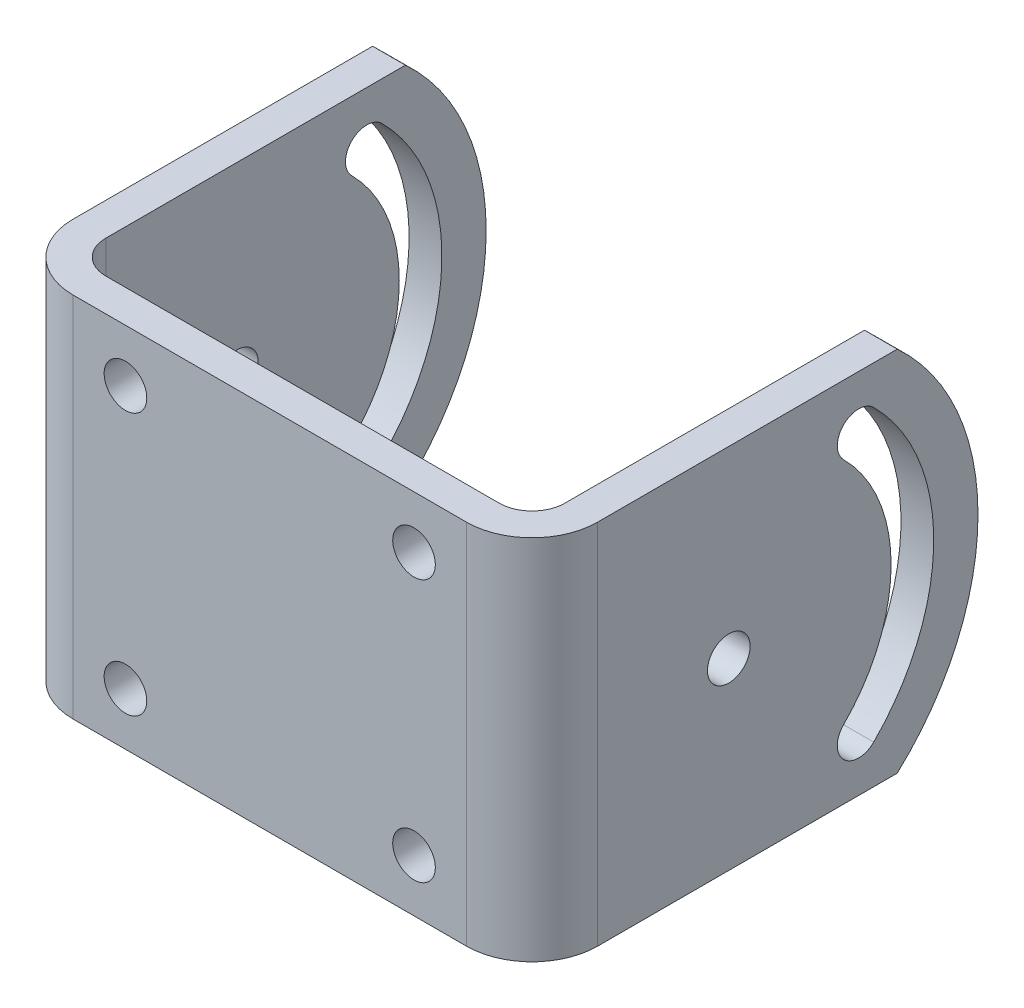
ISO-10303-21;
HEADER;
FILE_DESCRIPTION(('STEP AP214'),'2;1');
FILE_NAME('part.step','',(''),(''),'','','');
FILE_SCHEMA(('AUTOMOTIVE_DESIGN { 1 0 10303 214 1 1 1 1 }'));
ENDSEC;
DATA;
#1=APPLICATION_CONTEXT('core data for automotive mechanical design processes');
#2=APPLICATION_PROTOCOL_DEFINITION('international standard','automotive_design',2000,#1);
#3=PRODUCT_CONTEXT('',#1,'mechanical');
#4=PRODUCT('Part','Part','',(#3));
#5=PRODUCT_RELATED_PRODUCT_CATEGORY('part','',(#4));
#6=PRODUCT_DEFINITION_FORMATION('','',#4);
#7=PRODUCT_DEFINITION_CONTEXT('part definition',#1,'design');
#8=PRODUCT_DEFINITION('design','',#6,#7);
#9=PRODUCT_DEFINITION_SHAPE('','',#8);
#10=(LENGTH_UNIT() NAMED_UNIT(*) SI_UNIT(.MILLI.,.METRE.));
#11=(NAMED_UNIT(*) PLANE_ANGLE_UNIT() SI_UNIT($,.RADIAN.));
#12=(NAMED_UNIT(*) SI_UNIT($,.STERADIAN.) SOLID_ANGLE_UNIT());
#13=UNCERTAINTY_MEASURE_WITH_UNIT(LENGTH_MEASURE(1.E-05),#10,'distance_accuracy_value','');
#14=(GEOMETRIC_REPRESENTATION_CONTEXT(3) GLOBAL_UNCERTAINTY_ASSIGNED_CONTEXT((#13)) GLOBAL_UNIT_ASSIGNED_CONTEXT((#10,
#11,#12)) REPRESENTATION_CONTEXT('',''));
#15=CARTESIAN_POINT('',(0.,0.,0.));
#16=DIRECTION('',(0.,0.,1.));
#17=DIRECTION('',(1.,0.,0.));
#18=AXIS2_PLACEMENT_3D('',#15,#16,#17);
#19=CARTESIAN_POINT('',(-39.9999997680761,13.1115896804524,86.7010103081436));
#20=DIRECTION('',(-1.,0.,0.));
#21=DIRECTION('',(0.,0.,1.));
#22=AXIS2_PLACEMENT_3D('',#19,#20,#21);
#23=CYLINDRICAL_SURFACE('',#22,3.25);
#24=DIRECTION('',(-1.,0.,0.));
#25=VECTOR('',#24,1.);
#26=CARTESIAN_POINT('',(-39.9999997680761,10.8134926415961,88.9991073469999));
#27=LINE('',#26,#25);
#28=CARTESIAN_POINT('',(35.0000002319239,10.8134926415961,88.9991073469999));
#29=VERTEX_POINT('',#28);
#30=CARTESIAN_POINT('',(40.0000002319239,10.8134926415961,88.9991073469999));
#31=VERTEX_POINT('',#30);
#32=EDGE_CURVE('E151',#29,#31,#27,.F.);
#33=ORIENTED_EDGE('',*,*,#32,.F.);
#34=CARTESIAN_POINT('',(35.0000002319239,13.1115896804524,86.7010103081436));
#35=DIRECTION('',(-1.,0.,0.));
#36=DIRECTION('',(0.,0.,1.));
#37=AXIS2_PLACEMENT_3D('',#34,#35,#36);
#38=CIRCLE('',#37,3.25);
#39=CARTESIAN_POINT('',(35.0000002319239,15.4096867193086,84.4029132692874));
#40=VERTEX_POINT('',#39);
#41=EDGE_CURVE('E292',#40,#29,#38,.F.);
#42=ORIENTED_EDGE('',*,*,#41,.F.);
#43=DIRECTION('',(-1.,0.,0.));
#44=VECTOR('',#43,1.);
#45=CARTESIAN_POINT('',(-39.9999997680761,15.4096867193086,84.4029132692873));
#46=LINE('',#45,#44);
#47=CARTESIAN_POINT('',(40.0000002319239,15.4096867193086,84.4029132692873));
#48=VERTEX_POINT('',#47);
#49=EDGE_CURVE('E193',#40,#48,#46,.F.);
#50=ORIENTED_EDGE('',*,*,#49,.T.);
#51=CARTESIAN_POINT('',(40.0000002319239,13.1115896804524,86.7010103081436));
#52=DIRECTION('',(-1.,0.,0.));
#53=DIRECTION('',(0.,0.,1.));
#54=AXIS2_PLACEMENT_3D('',#51,#52,#53);
#55=CIRCLE('',#54,3.25);
#56=EDGE_CURVE('E299',#48,#31,#55,.F.);
#57=ORIENTED_EDGE('',*,*,#56,.T.);
#58=EDGE_LOOP('',(#33,#42,#50,#57));
#59=FACE_BOUND('',#58,.T.);
#60=ADVANCED_FACE('F17',(#59),#23,.F.);
#61=CARTESIAN_POINT('',(-39.9999997680761,-6.68740019277098,106.500000181367));
#62=DIRECTION('',(-1.,0.,0.));
#63=DIRECTION('',(0.,0.,1.));
#64=AXIS2_PLACEMENT_3D('',#61,#62,#63);
#65=CYLINDRICAL_SURFACE('',#64,24.75);
#66=CARTESIAN_POINT('',(35.0000002319239,-6.68740019277098,106.500000181367));
#67=DIRECTION('',(-1.,0.,0.));
#68=DIRECTION('',(0.,0.,1.));
#69=AXIS2_PLACEMENT_3D('',#66,#67,#68);
#70=CIRCLE('',#69,24.75);
#71=CARTESIAN_POINT('',(35.0000002319239,-24.188293027138,88.9991073469999));
#72=VERTEX_POINT('',#71);
#73=EDGE_CURVE('E290',#29,#72,#70,.T.);
#74=ORIENTED_EDGE('',*,*,#73,.F.);
#75=ORIENTED_EDGE('',*,*,#32,.T.);
#76=CARTESIAN_POINT('',(40.0000002319239,-6.68740019277098,106.500000181367));
#77=DIRECTION('',(-1.,0.,0.));
#78=DIRECTION('',(0.,0.,1.));
#79=AXIS2_PLACEMENT_3D('',#76,#77,#78);
#80=CIRCLE('',#79,24.75);
#81=CARTESIAN_POINT('',(40.0000002319239,-24.188293027138,88.9991073469999));
#82=VERTEX_POINT('',#81);
#83=EDGE_CURVE('E20',#31,#82,#80,.T.);
#84=ORIENTED_EDGE('',*,*,#83,.T.);
#85=DIRECTION('',(-1.,0.,0.));
#86=VECTOR('',#85,1.);
#87=CARTESIAN_POINT('',(-39.9999997680761,-24.188293027138,88.9991073469999));
#88=LINE('',#87,#86);
#89=EDGE_CURVE('E158',#82,#72,#88,.T.);
#90=ORIENTED_EDGE('',*,*,#89,.T.);
#91=EDGE_LOOP('',(#74,#75,#84,#90));
#92=FACE_BOUND('',#91,.T.);
#93=ADVANCED_FACE('F173',(#92),#65,.T.);
#94=CARTESIAN_POINT('',(-39.9999997680761,-26.4863900659943,86.7010103081436));
#95=DIRECTION('',(-1.,0.,0.));
#96=DIRECTION('',(0.,0.,1.));
#97=AXIS2_PLACEMENT_3D('',#94,#95,#96);
#98=CYLINDRICAL_SURFACE('',#97,3.25);
#99=DIRECTION('',(-1.,0.,0.));
#100=VECTOR('',#99,1.);
#101=CARTESIAN_POINT('',(-39.9999997680761,-28.7844871048505,84.4029132692874));
#102=LINE('',#101,#100);
#103=CARTESIAN_POINT('',(40.0000002319239,-28.7844871048505,84.4029132692873));
#104=VERTEX_POINT('',#103);
#105=CARTESIAN_POINT('',(35.0000002319239,-28.7844871048506,84.4029132692873));
#106=VERTEX_POINT('',#105);
#107=EDGE_CURVE('E164',#104,#106,#102,.T.);
#108=ORIENTED_EDGE('',*,*,#107,.T.);
#109=CARTESIAN_POINT('',(35.0000002319239,-26.4863900659943,86.7010103081436));
#110=DIRECTION('',(-1.,0.,0.));
#111=DIRECTION('',(0.,0.,1.));
#112=AXIS2_PLACEMENT_3D('',#109,#110,#111);
#113=CIRCLE('',#112,3.25);
#114=EDGE_CURVE('E163',#72,#106,#113,.F.);
#115=ORIENTED_EDGE('',*,*,#114,.F.);
#116=ORIENTED_EDGE('',*,*,#89,.F.);
#117=CARTESIAN_POINT('',(40.0000002319239,-26.4863900659943,86.7010103081436));
#118=DIRECTION('',(-1.,0.,0.));
#119=DIRECTION('',(0.,0.,1.));
#120=AXIS2_PLACEMENT_3D('',#117,#118,#119);
#121=CIRCLE('',#120,3.25);
#122=EDGE_CURVE('E162',#82,#104,#121,.F.);
#123=ORIENTED_EDGE('',*,*,#122,.T.);
#124=EDGE_LOOP('',(#108,#115,#116,#123));
#125=FACE_BOUND('',#124,.T.);
#126=ADVANCED_FACE('F161',(#125),#98,.F.);
#127=CARTESIAN_POINT('',(-39.9999997680761,-6.68740019277098,106.500000181367));
#128=DIRECTION('',(-1.,0.,0.));
#129=DIRECTION('',(0.,0.,1.));
#130=AXIS2_PLACEMENT_3D('',#127,#128,#129);
#131=CYLINDRICAL_SURFACE('',#130,31.25);
#132=ORIENTED_EDGE('',*,*,#49,.F.);
#133=CARTESIAN_POINT('',(35.0000002319239,-6.68740019277098,106.500000181367));
#134=DIRECTION('',(-1.,0.,0.));
#135=DIRECTION('',(0.,0.,1.));
#136=AXIS2_PLACEMENT_3D('',#133,#134,#135);
#137=CIRCLE('',#136,31.25);
#138=EDGE_CURVE('E286',#106,#40,#137,.F.);
#139=ORIENTED_EDGE('',*,*,#138,.F.);
#140=ORIENTED_EDGE('',*,*,#107,.F.);
#141=CARTESIAN_POINT('',(40.0000002319239,-6.68740019277098,106.500000181367));
#142=DIRECTION('',(-1.,0.,0.));
#143=DIRECTION('',(0.,0.,1.));
#144=AXIS2_PLACEMENT_3D('',#141,#142,#143);
#145=CIRCLE('',#144,31.25);
#146=EDGE_CURVE('E172',#104,#48,#145,.F.);
#147=ORIENTED_EDGE('',*,*,#146,.T.);
#148=EDGE_LOOP('',(#132,#139,#140,#147));
#149=FACE_BOUND('',#148,.T.);
#150=ADVANCED_FACE('F302',(#149),#131,.F.);
#151=CARTESIAN_POINT('',(-39.9999997680761,-6.68740019277098,106.500000181367));
#152=DIRECTION('',(-1.,0.,0.));
#153=DIRECTION('',(0.,0.,1.));
#154=AXIS2_PLACEMENT_3D('',#151,#152,#153);
#155=CYLINDRICAL_SURFACE('',#154,3.25);
#156=CARTESIAN_POINT('',(35.0000002319239,-6.68740019277098,106.500000181367));
#157=DIRECTION('',(-1.,0.,0.));
#158=DIRECTION('',(0.,0.,1.));
#159=AXIS2_PLACEMENT_3D('',#156,#157,#158);
#160=CIRCLE('',#159,3.25);
#161=CARTESIAN_POINT('',(35.0000002319239,-6.68740019277098,109.750000181367));
#162=VERTEX_POINT('',#161);
#163=EDGE_CURVE('E283',#162,#162,#160,.F.);
#164=ORIENTED_EDGE('',*,*,#163,.F.);
#165=EDGE_LOOP('',(#164));
#166=FACE_BOUND('',#165,.T.);
#167=CARTESIAN_POINT('',(40.0000002319239,-6.68740019277098,106.500000181367));
#168=DIRECTION('',(-1.,0.,0.));
#169=DIRECTION('',(0.,0.,1.));
#170=AXIS2_PLACEMENT_3D('',#167,#168,#169);
#171=CIRCLE('',#170,3.25);
#172=CARTESIAN_POINT('',(40.0000002319239,-6.68740019277098,109.750000181367));
#173=VERTEX_POINT('',#172);
#174=EDGE_CURVE('E296',#173,#173,#171,.F.);
#175=ORIENTED_EDGE('',*,*,#174,.T.);
#176=EDGE_LOOP('',(#175));
#177=FACE_BOUND('',#176,.T.);
#178=ADVANCED_FACE('F406',(#166,#177),#155,.F.);
#179=CARTESIAN_POINT('',(-39.9999997680761,-6.68740019277098,106.500000181367));
#180=DIRECTION('',(-1.,0.,0.));
#181=DIRECTION('',(0.,0.,1.));
#182=AXIS2_PLACEMENT_3D('',#179,#180,#181);
#183=CYLINDRICAL_SURFACE('',#182,24.75);
#184=CARTESIAN_POINT('',(-39.9999997680761,-6.68740019277098,106.500000181367));
#185=DIRECTION('',(-1.,0.,0.));
#186=DIRECTION('',(0.,0.,1.));
#187=AXIS2_PLACEMENT_3D('',#184,#185,#186);
#188=CIRCLE('',#187,24.75);
#189=CARTESIAN_POINT('',(-39.9999997680761,10.8134926415961,88.9991073469999));
#190=VERTEX_POINT('',#189);
#191=CARTESIAN_POINT('',(-39.9999997680761,-24.188293027138,88.9991073469999));
#192=VERTEX_POINT('',#191);
#193=EDGE_CURVE('E271',#190,#192,#188,.T.);
#194=ORIENTED_EDGE('',*,*,#193,.F.);
#195=DIRECTION('',(-1.,0.,0.));
#196=VECTOR('',#195,1.);
#197=CARTESIAN_POINT('',(-39.9999997680761,10.8134926415961,88.9991073469999));
#198=LINE('',#197,#196);
#199=CARTESIAN_POINT('',(-34.9999997680761,10.8134926415961,88.9991073469999));
#200=VERTEX_POINT('',#199);
#201=EDGE_CURVE('E174',#190,#200,#198,.F.);
#202=ORIENTED_EDGE('',*,*,#201,.T.);
#203=CARTESIAN_POINT('',(-34.9999997680761,-6.68740019277098,106.500000181367));
#204=DIRECTION('',(-1.,0.,0.));
#205=DIRECTION('',(0.,0.,1.));
#206=AXIS2_PLACEMENT_3D('',#203,#204,#205);
#207=CIRCLE('',#206,24.75);
#208=CARTESIAN_POINT('',(-34.9999997680761,-24.188293027138,88.9991073469999));
#209=VERTEX_POINT('',#208);
#210=EDGE_CURVE('E262',#200,#209,#207,.T.);
#211=ORIENTED_EDGE('',*,*,#210,.T.);
#212=DIRECTION('',(-1.,0.,0.));
#213=VECTOR('',#212,1.);
#214=CARTESIAN_POINT('',(-39.9999997680761,-24.188293027138,88.9991073469999));
#215=LINE('',#214,#213);
#216=EDGE_CURVE('E190',#209,#192,#215,.T.);
#217=ORIENTED_EDGE('',*,*,#216,.T.);
#218=EDGE_LOOP('',(#194,#202,#211,#217));
#219=FACE_BOUND('',#218,.T.);
#220=ADVANCED_FACE('F402',(#219),#183,.T.);
#221=CARTESIAN_POINT('',(-39.9999997680761,-26.4863900659943,86.7010103081436));
#222=DIRECTION('',(-1.,0.,0.));
#223=DIRECTION('',(0.,0.,1.));
#224=AXIS2_PLACEMENT_3D('',#221,#222,#223);
#225=CYLINDRICAL_SURFACE('',#224,3.25);
#226=DIRECTION('',(-1.,0.,0.));
#227=VECTOR('',#226,1.);
#228=CARTESIAN_POINT('',(-39.9999997680761,-28.7844871048505,84.4029132692874));
#229=LINE('',#228,#227);
#230=CARTESIAN_POINT('',(-34.9999997680761,-28.7844871048505,84.4029132692873));
#231=VERTEX_POINT('',#230);
#232=CARTESIAN_POINT('',(-39.9999997680761,-28.7844871048506,84.4029132692873));
#233=VERTEX_POINT('',#232);
#234=EDGE_CURVE('E183',#231,#233,#229,.T.);
#235=ORIENTED_EDGE('',*,*,#234,.T.);
#236=CARTESIAN_POINT('',(-39.9999997680761,-26.4863900659943,86.7010103081436));
#237=DIRECTION('',(-1.,0.,0.));
#238=DIRECTION('',(0.,0.,1.));
#239=AXIS2_PLACEMENT_3D('',#236,#237,#238);
#240=CIRCLE('',#239,3.25);
#241=EDGE_CURVE('E268',#192,#233,#240,.F.);
#242=ORIENTED_EDGE('',*,*,#241,.F.);
#243=ORIENTED_EDGE('',*,*,#216,.F.);
#244=CARTESIAN_POINT('',(-34.9999997680761,-26.4863900659943,86.7010103081436));
#245=DIRECTION('',(-1.,0.,0.));
#246=DIRECTION('',(0.,0.,1.));
#247=AXIS2_PLACEMENT_3D('',#244,#245,#246);
#248=CIRCLE('',#247,3.25);
#249=EDGE_CURVE('E259',#209,#231,#248,.F.);
#250=ORIENTED_EDGE('',*,*,#249,.T.);
#251=EDGE_LOOP('',(#235,#242,#243,#250));
#252=FACE_BOUND('',#251,.T.);
#253=ADVANCED_FACE('F398',(#252),#225,.F.);
#254=CARTESIAN_POINT('',(-39.9999997680761,-6.68740019277098,106.500000181367));
#255=DIRECTION('',(-1.,0.,0.));
#256=DIRECTION('',(0.,0.,1.));
#257=AXIS2_PLACEMENT_3D('',#254,#255,#256);
#258=CYLINDRICAL_SURFACE('',#257,31.25);
#259=DIRECTION('',(-1.,0.,0.));
#260=VECTOR('',#259,1.);
#261=CARTESIAN_POINT('',(-39.9999997680761,15.4096867193086,84.4029132692873));
#262=LINE('',#261,#260);
#263=CARTESIAN_POINT('',(-34.9999997680761,15.4096867193087,84.4029132692873));
#264=VERTEX_POINT('',#263);
#265=CARTESIAN_POINT('',(-39.9999997680761,15.4096867193086,84.4029132692873));
#266=VERTEX_POINT('',#265);
#267=EDGE_CURVE('E176',#264,#266,#262,.T.);
#268=ORIENTED_EDGE('',*,*,#267,.T.);
#269=CARTESIAN_POINT('',(-39.9999997680761,-6.68740019277098,106.500000181367));
#270=DIRECTION('',(-1.,0.,0.));
#271=DIRECTION('',(0.,0.,1.));
#272=AXIS2_PLACEMENT_3D('',#269,#270,#271);
#273=CIRCLE('',#272,31.25);
#274=EDGE_CURVE('E276',#233,#266,#273,.F.);
#275=ORIENTED_EDGE('',*,*,#274,.F.);
#276=ORIENTED_EDGE('',*,*,#234,.F.);
#277=CARTESIAN_POINT('',(-34.9999997680761,-6.68740019277098,106.500000181367));
#278=DIRECTION('',(-1.,0.,0.));
#279=DIRECTION('',(0.,0.,1.));
#280=AXIS2_PLACEMENT_3D('',#277,#278,#279);
#281=CIRCLE('',#280,31.25);
#282=EDGE_CURVE('E256',#231,#264,#281,.F.);
#283=ORIENTED_EDGE('',*,*,#282,.T.);
#284=EDGE_LOOP('',(#268,#275,#276,#283));
#285=FACE_BOUND('',#284,.T.);
#286=ADVANCED_FACE('F394',(#285),#258,.F.);
#287=CARTESIAN_POINT('',(-39.9999997680761,13.1115896804524,86.7010103081436));
#288=DIRECTION('',(-1.,0.,0.));
#289=DIRECTION('',(0.,0.,1.));
#290=AXIS2_PLACEMENT_3D('',#287,#288,#289);
#291=CYLINDRICAL_SURFACE('',#290,3.25);
#292=ORIENTED_EDGE('',*,*,#201,.F.);
#293=CARTESIAN_POINT('',(-39.9999997680761,13.1115896804524,86.7010103081436));
#294=DIRECTION('',(-1.,0.,0.));
#295=DIRECTION('',(0.,0.,1.));
#296=AXIS2_PLACEMENT_3D('',#293,#294,#295);
#297=CIRCLE('',#296,3.25);
#298=EDGE_CURVE('E273',#266,#190,#297,.F.);
#299=ORIENTED_EDGE('',*,*,#298,.F.);
#300=ORIENTED_EDGE('',*,*,#267,.F.);
#301=CARTESIAN_POINT('',(-34.9999997680761,13.1115896804524,86.7010103081436));
#302=DIRECTION('',(-1.,0.,0.));
#303=DIRECTION('',(0.,0.,1.));
#304=AXIS2_PLACEMENT_3D('',#301,#302,#303);
#305=CIRCLE('',#304,3.25);
#306=EDGE_CURVE('E254',#264,#200,#305,.F.);
#307=ORIENTED_EDGE('',*,*,#306,.T.);
#308=EDGE_LOOP('',(#292,#299,#300,#307));
#309=FACE_BOUND('',#308,.T.);
#310=ADVANCED_FACE('F390',(#309),#291,.F.);
#311=CARTESIAN_POINT('',(-39.9999997680761,-6.68740019277098,106.500000181367));
#312=DIRECTION('',(-1.,0.,0.));
#313=DIRECTION('',(0.,0.,1.));
#314=AXIS2_PLACEMENT_3D('',#311,#312,#313);
#315=CYLINDRICAL_SURFACE('',#314,3.25);
#316=CARTESIAN_POINT('',(-34.9999997680761,-6.68740019277098,106.500000181367));
#317=DIRECTION('',(-1.,0.,0.));
#318=DIRECTION('',(0.,0.,1.));
#319=AXIS2_PLACEMENT_3D('',#316,#317,#318);
#320=CIRCLE('',#319,3.25);
#321=CARTESIAN_POINT('',(-34.9999997680761,-6.68740019277098,109.750000181367));
#322=VERTEX_POINT('',#321);
#323=EDGE_CURVE('E251',#322,#322,#320,.F.);
#324=ORIENTED_EDGE('',*,*,#323,.T.);
#325=EDGE_LOOP('',(#324));
#326=FACE_BOUND('',#325,.T.);
#327=CARTESIAN_POINT('',(-39.9999997680761,-6.68740019277098,106.500000181367));
#328=DIRECTION('',(-1.,0.,0.));
#329=DIRECTION('',(0.,0.,1.));
#330=AXIS2_PLACEMENT_3D('',#327,#328,#329);
#331=CIRCLE('',#330,3.25);
#332=CARTESIAN_POINT('',(-39.9999997680761,-6.68740019277098,109.750000181367));
#333=VERTEX_POINT('',#332);
#334=EDGE_CURVE('E278',#333,#333,#331,.F.);
#335=ORIENTED_EDGE('',*,*,#334,.F.);
#336=EDGE_LOOP('',(#335));
#337=FACE_BOUND('',#336,.T.);
#338=ADVANCED_FACE('F386',(#326,#337),#315,.F.);
#339=CARTESIAN_POINT('',(40.0000002319239,-4.03756275760834,80.8215675263217));
#340=DIRECTION('',(-1.,0.,0.));
#341=DIRECTION('',(0.,0.,1.));
#342=AXIS2_PLACEMENT_3D('',#339,#340,#341);
#343=PLANE('',#342);
#344=DIRECTION('',(0.,0.,1.));
#345=VECTOR('',#344,1.);
#346=CARTESIAN_POINT('',(40.0000002319239,-34.6874001927711,126.500000181368));
#347=LINE('',#346,#345);
#348=CARTESIAN_POINT('',(40.0000002319239,-34.6874001927711,126.500000181368));
#349=VERTEX_POINT('',#348);
#350=CARTESIAN_POINT('',(40.0000002319239,-34.6874001927722,80.809535024038));
#351=VERTEX_POINT('',#350);
#352=EDGE_CURVE('E246',#349,#351,#347,.F.);
#353=ORIENTED_EDGE('',*,*,#352,.T.);
#354=CARTESIAN_POINT('',(40.0000002319239,-6.68740019277098,106.500000181367));
#355=DIRECTION('',(-1.,0.,0.));
#356=DIRECTION('',(0.,0.,1.));
#357=AXIS2_PLACEMENT_3D('',#354,#355,#356);
#358=CIRCLE('',#357,38.);
#359=CARTESIAN_POINT('',(40.0000002319239,21.3125998072287,80.8095350240363));
#360=VERTEX_POINT('',#359);
#361=EDGE_CURVE('E294',#360,#351,#358,.T.);
#362=ORIENTED_EDGE('',*,*,#361,.F.);
#363=DIRECTION('',(0.,0.,1.));
#364=VECTOR('',#363,1.);
#365=CARTESIAN_POINT('',(40.0000002319239,21.3125998072316,208.491148756495));
#366=LINE('',#365,#364);
#367=CARTESIAN_POINT('',(40.0000002319239,21.3125998072297,126.500000181367));
#368=VERTEX_POINT('',#367);
#369=EDGE_CURVE('E628',#368,#360,#366,.F.);
#370=ORIENTED_EDGE('',*,*,#369,.F.);
#371=DIRECTION('',(0.,-1.,0.));
#372=VECTOR('',#371,1.);
#373=CARTESIAN_POINT('',(40.0000002319239,-34.6874001927711,126.500000181368));
#374=LINE('',#373,#372);
#375=EDGE_CURVE('E264',#349,#368,#374,.F.);
#376=ORIENTED_EDGE('',*,*,#375,.F.);
#377=EDGE_LOOP('',(#353,#362,#370,#376));
#378=FACE_BOUND('',#377,.T.);
#379=ORIENTED_EDGE('',*,*,#174,.F.);
#380=EDGE_LOOP('',(#379));
#381=FACE_BOUND('',#380,.T.);
#382=ORIENTED_EDGE('',*,*,#146,.F.);
#383=ORIENTED_EDGE('',*,*,#122,.F.);
#384=ORIENTED_EDGE('',*,*,#83,.F.);
#385=ORIENTED_EDGE('',*,*,#56,.F.);
#386=EDGE_LOOP('',(#382,#383,#384,#385));
#387=FACE_BOUND('',#386,.T.);
#388=ADVANCED_FACE('F168',(#378,#381,#387),#343,.F.);
#389=CARTESIAN_POINT('',(-39.9999997680761,-6.68740019277098,106.500000181367));
#390=DIRECTION('',(-1.,0.,0.));
#391=DIRECTION('',(0.,0.,1.));
#392=AXIS2_PLACEMENT_3D('',#389,#390,#391);
#393=CYLINDRICAL_SURFACE('',#392,38.);
#394=DIRECTION('',(1.,0.,0.));
#395=VECTOR('',#394,1.);
#396=CARTESIAN_POINT('',(-29.9999997680761,-34.6874001927722,80.809535024038));
#397=LINE('',#396,#395);
#398=CARTESIAN_POINT('',(35.0000002319239,-34.6874001927722,80.809535024038));
#399=VERTEX_POINT('',#398);
#400=EDGE_CURVE('E186',#351,#399,#397,.F.);
#401=ORIENTED_EDGE('',*,*,#400,.T.);
#402=CARTESIAN_POINT('',(35.0000002319239,-6.68740019277098,106.500000181367));
#403=DIRECTION('',(-1.,0.,0.));
#404=DIRECTION('',(0.,0.,1.));
#405=AXIS2_PLACEMENT_3D('',#402,#403,#404);
#406=CIRCLE('',#405,38.);
#407=CARTESIAN_POINT('',(35.0000002319239,21.3125998072287,80.8095350240363));
#408=VERTEX_POINT('',#407);
#409=EDGE_CURVE('E281',#408,#399,#406,.T.);
#410=ORIENTED_EDGE('',*,*,#409,.F.);
#411=DIRECTION('',(1.,0.,0.));
#412=VECTOR('',#411,1.);
#413=CARTESIAN_POINT('',(-29.9999997680761,21.3125998072287,80.8095350240363));
#414=LINE('',#413,#412);
#415=EDGE_CURVE('E629',#360,#408,#414,.F.);
#416=ORIENTED_EDGE('',*,*,#415,.F.);
#417=ORIENTED_EDGE('',*,*,#361,.T.);
#418=EDGE_LOOP('',(#401,#410,#416,#417));
#419=FACE_BOUND('',#418,.T.);
#420=ADVANCED_FACE('F379',(#419),#393,.T.);
#421=CARTESIAN_POINT('',(35.0000002319239,-4.03756275760834,80.8215675263217));
#422=DIRECTION('',(-1.,0.,0.));
#423=DIRECTION('',(0.,0.,1.));
#424=AXIS2_PLACEMENT_3D('',#421,#422,#423);
#425=PLANE('',#424);
#426=DIRECTION('',(0.,-1.,0.));
#427=VECTOR('',#426,1.);
#428=CARTESIAN_POINT('',(35.0000002319239,-34.6874001927711,126.500000181368));
#429=LINE('',#428,#427);
#430=CARTESIAN_POINT('',(35.0000002319239,-34.6874001927711,126.500000181368));
#431=VERTEX_POINT('',#430);
#432=CARTESIAN_POINT('',(35.0000002319239,21.3125998072297,126.500000181367));
#433=VERTEX_POINT('',#432);
#434=EDGE_CURVE('E238',#431,#433,#429,.F.);
#435=ORIENTED_EDGE('',*,*,#434,.T.);
#436=DIRECTION('',(0.,0.,1.));
#437=VECTOR('',#436,1.);
#438=CARTESIAN_POINT('',(35.0000002319239,21.3125998072316,208.491148756495));
#439=LINE('',#438,#437);
#440=EDGE_CURVE('E234',#408,#433,#439,.T.);
#441=ORIENTED_EDGE('',*,*,#440,.F.);
#442=ORIENTED_EDGE('',*,*,#409,.T.);
#443=DIRECTION('',(0.,0.,1.));
#444=VECTOR('',#443,1.);
#445=CARTESIAN_POINT('',(35.0000002319239,-34.6874001927711,126.500000181368));
#446=LINE('',#445,#444);
#447=EDGE_CURVE('E611',#399,#431,#446,.T.);
#448=ORIENTED_EDGE('',*,*,#447,.T.);
#449=EDGE_LOOP('',(#435,#441,#442,#448));
#450=FACE_BOUND('',#449,.T.);
#451=ORIENTED_EDGE('',*,*,#163,.T.);
#452=EDGE_LOOP('',(#451));
#453=FACE_BOUND('',#452,.T.);
#454=ORIENTED_EDGE('',*,*,#114,.T.);
#455=ORIENTED_EDGE('',*,*,#138,.T.);
#456=ORIENTED_EDGE('',*,*,#41,.T.);
#457=ORIENTED_EDGE('',*,*,#73,.T.);
#458=EDGE_LOOP('',(#454,#455,#456,#457));
#459=FACE_BOUND('',#458,.T.);
#460=ADVANCED_FACE('F306',(#450,#453,#459),#425,.T.);
#461=CARTESIAN_POINT('',(-39.9999997680761,-6.68740019277098,106.500000181367));
#462=DIRECTION('',(-1.,0.,0.));
#463=DIRECTION('',(0.,0.,1.));
#464=AXIS2_PLACEMENT_3D('',#461,#462,#463);
#465=CYLINDRICAL_SURFACE('',#464,38.);
#466=CARTESIAN_POINT('',(-39.9999997680761,-6.68740019277098,106.500000181367));
#467=DIRECTION('',(-1.,0.,0.));
#468=DIRECTION('',(0.,0.,1.));
#469=AXIS2_PLACEMENT_3D('',#466,#467,#468);
#470=CIRCLE('',#469,38.);
#471=CARTESIAN_POINT('',(-39.9999997680761,21.3125998072287,80.8095350240363));
#472=VERTEX_POINT('',#471);
#473=CARTESIAN_POINT('',(-39.9999997680761,-34.6874001927722,80.809535024038));
#474=VERTEX_POINT('',#473);
#475=EDGE_CURVE('E265',#472,#474,#470,.T.);
#476=ORIENTED_EDGE('',*,*,#475,.F.);
#477=DIRECTION('',(1.,0.,0.));
#478=VECTOR('',#477,1.);
#479=CARTESIAN_POINT('',(-29.9999997680761,21.3125998072287,80.8095350240363));
#480=LINE('',#479,#478);
#481=CARTESIAN_POINT('',(-34.9999997680761,21.3125998072287,80.8095350240363));
#482=VERTEX_POINT('',#481);
#483=EDGE_CURVE('E624',#482,#472,#480,.F.);
#484=ORIENTED_EDGE('',*,*,#483,.F.);
#485=CARTESIAN_POINT('',(-34.9999997680761,-6.68740019277098,106.500000181367));
#486=DIRECTION('',(-1.,0.,0.));
#487=DIRECTION('',(0.,0.,1.));
#488=AXIS2_PLACEMENT_3D('',#485,#486,#487);
#489=CIRCLE('',#488,38.);
#490=CARTESIAN_POINT('',(-34.9999997680761,-34.6874001927722,80.809535024038));
#491=VERTEX_POINT('',#490);
#492=EDGE_CURVE('E248',#482,#491,#489,.T.);
#493=ORIENTED_EDGE('',*,*,#492,.T.);
#494=DIRECTION('',(1.,0.,0.));
#495=VECTOR('',#494,1.);
#496=CARTESIAN_POINT('',(-29.9999997680761,-34.6874001927722,80.809535024038));
#497=LINE('',#496,#495);
#498=EDGE_CURVE('E630',#491,#474,#497,.F.);
#499=ORIENTED_EDGE('',*,*,#498,.T.);
#500=EDGE_LOOP('',(#476,#484,#493,#499));
#501=FACE_BOUND('',#500,.T.);
#502=ADVANCED_FACE('F372',(#501),#465,.T.);
#503=CARTESIAN_POINT('',(-39.9999997680761,-4.03756275760834,80.8215675263217));
#504=DIRECTION('',(-1.,0.,0.));
#505=DIRECTION('',(0.,0.,1.));
#506=AXIS2_PLACEMENT_3D('',#503,#504,#505);
#507=PLANE('',#506);
#508=DIRECTION('',(0.,0.,1.));
#509=VECTOR('',#508,1.);
#510=CARTESIAN_POINT('',(-39.9999997680761,-34.6874001927711,126.500000181368));
#511=LINE('',#510,#509);
#512=CARTESIAN_POINT('',(-39.9999997680761,-34.6874001927711,126.500000181368));
#513=VERTEX_POINT('',#512);
#514=EDGE_CURVE('E242',#474,#513,#511,.T.);
#515=ORIENTED_EDGE('',*,*,#514,.T.);
#516=DIRECTION('',(0.,1.,0.));
#517=VECTOR('',#516,1.);
#518=CARTESIAN_POINT('',(-39.9999997680761,21.3125998072297,126.500000181367));
#519=LINE('',#518,#517);
#520=CARTESIAN_POINT('',(-39.9999997680761,21.3125998072297,126.500000181367));
#521=VERTEX_POINT('',#520);
#522=EDGE_CURVE('E267',#521,#513,#519,.F.);
#523=ORIENTED_EDGE('',*,*,#522,.F.);
#524=DIRECTION('',(0.,0.,1.));
#525=VECTOR('',#524,1.);
#526=CARTESIAN_POINT('',(-39.9999997680761,21.3125998072316,208.491148756495));
#527=LINE('',#526,#525);
#528=EDGE_CURVE('E230',#472,#521,#527,.T.);
#529=ORIENTED_EDGE('',*,*,#528,.F.);
#530=ORIENTED_EDGE('',*,*,#475,.T.);
#531=EDGE_LOOP('',(#515,#523,#529,#530));
#532=FACE_BOUND('',#531,.T.);
#533=ORIENTED_EDGE('',*,*,#193,.T.);
#534=ORIENTED_EDGE('',*,*,#241,.T.);
#535=ORIENTED_EDGE('',*,*,#274,.T.);
#536=ORIENTED_EDGE('',*,*,#298,.T.);
#537=EDGE_LOOP('',(#533,#534,#535,#536));
#538=FACE_BOUND('',#537,.T.);
#539=ORIENTED_EDGE('',*,*,#334,.T.);
#540=EDGE_LOOP('',(#539));
#541=FACE_BOUND('',#540,.T.);
#542=ADVANCED_FACE('F368',(#532,#538,#541),#507,.T.);
#543=CARTESIAN_POINT('',(-29.9999997680761,21.3125998072297,126.500000181367));
#544=DIRECTION('',(0.,1.,0.));
#545=DIRECTION('',(0.,0.,1.));
#546=AXIS2_PLACEMENT_3D('',#543,#544,#545);
#547=CYLINDRICAL_SURFACE('',#546,10.);
#548=ORIENTED_EDGE('',*,*,#522,.T.);
#549=CARTESIAN_POINT('',(-29.9999997680761,-34.6874001927711,126.500000181368));
#550=DIRECTION('',(0.,1.,0.));
#551=DIRECTION('',(0.,0.,1.));
#552=AXIS2_PLACEMENT_3D('',#549,#550,#551);
#553=CIRCLE('',#552,10.);
#554=CARTESIAN_POINT('',(-29.9999997680761,-34.6874001927709,136.500000181368));
#555=VERTEX_POINT('',#554);
#556=EDGE_CURVE('E239',#513,#555,#553,.T.);
#557=ORIENTED_EDGE('',*,*,#556,.T.);
#558=DIRECTION('',(0.,-1.,0.));
#559=VECTOR('',#558,1.);
#560=CARTESIAN_POINT('',(-29.9999997680761,13.4809026850699,136.500000181367));
#561=LINE('',#560,#559);
#562=CARTESIAN_POINT('',(-29.9999997680761,21.3125998072299,136.500000181367));
#563=VERTEX_POINT('',#562);
#564=EDGE_CURVE('E617',#563,#555,#561,.T.);
#565=ORIENTED_EDGE('',*,*,#564,.F.);
#566=CARTESIAN_POINT('',(-29.9999997680761,21.3125998072297,126.500000181367));
#567=DIRECTION('',(0.,1.,0.));
#568=DIRECTION('',(0.,0.,1.));
#569=AXIS2_PLACEMENT_3D('',#566,#567,#568);
#570=CIRCLE('',#569,10.);
#571=EDGE_CURVE('E228',#521,#563,#570,.T.);
#572=ORIENTED_EDGE('',*,*,#571,.F.);
#573=EDGE_LOOP('',(#548,#557,#565,#572));
#574=FACE_BOUND('',#573,.T.);
#575=ADVANCED_FACE('F364',(#574),#547,.T.);
#576=CARTESIAN_POINT('',(30.0000002319239,-34.6874001927711,126.500000181368));
#577=DIRECTION('',(0.,-1.,0.));
#578=DIRECTION('',(0.,0.,-1.));
#579=AXIS2_PLACEMENT_3D('',#576,#577,#578);
#580=CYLINDRICAL_SURFACE('',#579,10.);
#581=ORIENTED_EDGE('',*,*,#375,.T.);
#582=CARTESIAN_POINT('',(30.0000002319239,21.3125998072297,126.500000181367));
#583=DIRECTION('',(0.,-1.,0.));
#584=DIRECTION('',(0.,0.,-1.));
#585=AXIS2_PLACEMENT_3D('',#582,#583,#584);
#586=CIRCLE('',#585,10.);
#587=CARTESIAN_POINT('',(30.0000002319239,21.3125998072299,136.500000181367));
#588=VERTEX_POINT('',#587);
#589=EDGE_CURVE('E224',#588,#368,#586,.F.);
#590=ORIENTED_EDGE('',*,*,#589,.F.);
#591=DIRECTION('',(0.,-1.,0.));
#592=VECTOR('',#591,1.);
#593=CARTESIAN_POINT('',(30.0000002319239,13.4809026850699,136.500000181367));
#594=LINE('',#593,#592);
#595=CARTESIAN_POINT('',(30.0000002319239,-34.6874001927709,136.500000181368));
#596=VERTEX_POINT('',#595);
#597=EDGE_CURVE('E250',#596,#588,#594,.F.);
#598=ORIENTED_EDGE('',*,*,#597,.F.);
#599=CARTESIAN_POINT('',(30.0000002319239,-34.6874001927711,126.500000181368));
#600=DIRECTION('',(0.,-1.,0.));
#601=DIRECTION('',(0.,0.,-1.));
#602=AXIS2_PLACEMENT_3D('',#599,#600,#601);
#603=CIRCLE('',#602,10.);
#604=EDGE_CURVE('E243',#596,#349,#603,.F.);
#605=ORIENTED_EDGE('',*,*,#604,.T.);
#606=EDGE_LOOP('',(#581,#590,#598,#605));
#607=FACE_BOUND('',#606,.T.);
#608=ADVANCED_FACE('F360',(#607),#580,.T.);
#609=CARTESIAN_POINT('',(-34.9999997680761,-4.03756275760834,80.8215675263217));
#610=DIRECTION('',(-1.,0.,0.));
#611=DIRECTION('',(0.,0.,1.));
#612=AXIS2_PLACEMENT_3D('',#609,#610,#611);
#613=PLANE('',#612);
#614=DIRECTION('',(0.,1.,0.));
#615=VECTOR('',#614,1.);
#616=CARTESIAN_POINT('',(-34.9999997680761,21.3125998072297,126.500000181367));
#617=LINE('',#616,#615);
#618=CARTESIAN_POINT('',(-34.9999997680761,21.3125998072297,126.500000181367));
#619=VERTEX_POINT('',#618);
#620=CARTESIAN_POINT('',(-34.9999997680761,-34.6874001927711,126.500000181368));
#621=VERTEX_POINT('',#620);
#622=EDGE_CURVE('E222',#619,#621,#617,.F.);
#623=ORIENTED_EDGE('',*,*,#622,.T.);
#624=DIRECTION('',(0.,0.,1.));
#625=VECTOR('',#624,1.);
#626=CARTESIAN_POINT('',(-34.9999997680761,-34.6874001927711,126.500000181368));
#627=LINE('',#626,#625);
#628=EDGE_CURVE('E632',#621,#491,#627,.F.);
#629=ORIENTED_EDGE('',*,*,#628,.T.);
#630=ORIENTED_EDGE('',*,*,#492,.F.);
#631=DIRECTION('',(0.,0.,1.));
#632=VECTOR('',#631,1.);
#633=CARTESIAN_POINT('',(-34.9999997680761,21.3125998072316,208.491148756495));
#634=LINE('',#633,#632);
#635=EDGE_CURVE('E233',#619,#482,#634,.F.);
#636=ORIENTED_EDGE('',*,*,#635,.F.);
#637=EDGE_LOOP('',(#623,#629,#630,#636));
#638=FACE_BOUND('',#637,.T.);
#639=ORIENTED_EDGE('',*,*,#323,.F.);
#640=EDGE_LOOP('',(#639));
#641=FACE_BOUND('',#640,.T.);
#642=ORIENTED_EDGE('',*,*,#282,.F.);
#643=ORIENTED_EDGE('',*,*,#249,.F.);
#644=ORIENTED_EDGE('',*,*,#210,.F.);
#645=ORIENTED_EDGE('',*,*,#306,.F.);
#646=EDGE_LOOP('',(#642,#643,#644,#645));
#647=FACE_BOUND('',#646,.T.);
#648=ADVANCED_FACE('F356',(#638,#641,#647),#613,.F.);
#649=CARTESIAN_POINT('',(42.2030829567192,13.4809026850699,136.500000181367));
#650=DIRECTION('',(0.,0.,1.));
#651=DIRECTION('',(0.,-1.,0.));
#652=AXIS2_PLACEMENT_3D('',#649,#650,#651);
#653=PLANE('',#652);
#654=CARTESIAN_POINT('',(-22.,-26.6874,136.500000181368));
#655=DIRECTION('',(0.,0.,-1.));
#656=DIRECTION('',(0.,1.,0.));
#657=AXIS2_PLACEMENT_3D('',#654,#655,#656);
#658=CIRCLE('',#657,3.25);
#659=CARTESIAN_POINT('',(-22.,-23.4374,136.500000181368));
#660=VERTEX_POINT('',#659);
#661=EDGE_CURVE('E206',#660,#660,#658,.T.);
#662=ORIENTED_EDGE('',*,*,#661,.T.);
#663=EDGE_LOOP('',(#662));
#664=FACE_BOUND('',#663,.T.);
#665=CARTESIAN_POINT('',(-22.,13.3126,136.500000181367));
#666=DIRECTION('',(0.,0.,-1.));
#667=DIRECTION('',(0.,1.,0.));
#668=AXIS2_PLACEMENT_3D('',#665,#666,#667);
#669=CIRCLE('',#668,3.25);
#670=CARTESIAN_POINT('',(-22.,16.5626,136.500000181367));
#671=VERTEX_POINT('',#670);
#672=EDGE_CURVE('E216',#671,#671,#669,.T.);
#673=ORIENTED_EDGE('',*,*,#672,.T.);
#674=EDGE_LOOP('',(#673));
#675=FACE_BOUND('',#674,.T.);
#676=CARTESIAN_POINT('',(22.,-26.6874,136.500000181368));
#677=DIRECTION('',(0.,0.,-1.));
#678=DIRECTION('',(0.,1.,0.));
#679=AXIS2_PLACEMENT_3D('',#676,#677,#678);
#680=CIRCLE('',#679,3.25);
#681=CARTESIAN_POINT('',(22.,-23.4374,136.500000181368));
#682=VERTEX_POINT('',#681);
#683=EDGE_CURVE('E213',#682,#682,#680,.T.);
#684=ORIENTED_EDGE('',*,*,#683,.T.);
#685=EDGE_LOOP('',(#684));
#686=FACE_BOUND('',#685,.T.);
#687=CARTESIAN_POINT('',(22.,13.3126,136.500000181367));
#688=DIRECTION('',(0.,0.,-1.));
#689=DIRECTION('',(0.,1.,0.));
#690=AXIS2_PLACEMENT_3D('',#687,#688,#689);
#691=CIRCLE('',#690,3.25);
#692=CARTESIAN_POINT('',(22.,16.5626,136.500000181367));
#693=VERTEX_POINT('',#692);
#694=EDGE_CURVE('E210',#693,#693,#691,.T.);
#695=ORIENTED_EDGE('',*,*,#694,.T.);
#696=EDGE_LOOP('',(#695));
#697=FACE_BOUND('',#696,.T.);
#698=ORIENTED_EDGE('',*,*,#564,.T.);
#699=DIRECTION('',(1.,0.,0.));
#700=VECTOR('',#699,1.);
#701=CARTESIAN_POINT('',(-29.9999997680761,-34.6874001927709,136.500000181368));
#702=LINE('',#701,#700);
#703=EDGE_CURVE('E247',#555,#596,#702,.T.);
#704=ORIENTED_EDGE('',*,*,#703,.T.);
#705=ORIENTED_EDGE('',*,*,#597,.T.);
#706=DIRECTION('',(1.,0.,0.));
#707=VECTOR('',#706,1.);
#708=CARTESIAN_POINT('',(-29.9999997680761,21.31259980723,136.500000181367));
#709=LINE('',#708,#707);
#710=EDGE_CURVE('E227',#563,#588,#709,.T.);
#711=ORIENTED_EDGE('',*,*,#710,.F.);
#712=EDGE_LOOP('',(#698,#704,#705,#711));
#713=FACE_BOUND('',#712,.T.);
#714=ADVANCED_FACE('F352',(#664,#675,#686,#697,#713),#653,.T.);
#715=CARTESIAN_POINT('',(-29.9999997680761,-34.6874001927711,126.500000181368));
#716=DIRECTION('',(0.,1.,0.));
#717=DIRECTION('',(0.,0.,1.));
#718=AXIS2_PLACEMENT_3D('',#715,#716,#717);
#719=PLANE('',#718);
#720=ORIENTED_EDGE('',*,*,#514,.F.);
#721=ORIENTED_EDGE('',*,*,#498,.F.);
#722=ORIENTED_EDGE('',*,*,#628,.F.);
#723=CARTESIAN_POINT('',(-29.9999997680761,-34.6874001927711,126.500000181368));
#724=DIRECTION('',(0.,1.,0.));
#725=DIRECTION('',(0.,0.,1.));
#726=AXIS2_PLACEMENT_3D('',#723,#724,#725);
#727=CIRCLE('',#726,5.);
#728=CARTESIAN_POINT('',(-29.9999997680761,-34.687400192771,131.500000181368));
#729=VERTEX_POINT('',#728);
#730=EDGE_CURVE('E219',#621,#729,#727,.T.);
#731=ORIENTED_EDGE('',*,*,#730,.T.);
#732=DIRECTION('',(1.,0.,0.));
#733=VECTOR('',#732,1.);
#734=CARTESIAN_POINT('',(42.2030829567192,-34.687400192771,131.500000181368));
#735=LINE('',#734,#733);
#736=CARTESIAN_POINT('',(30.0000002319239,-34.687400192771,131.500000181368));
#737=VERTEX_POINT('',#736);
#738=EDGE_CURVE('E209',#729,#737,#735,.T.);
#739=ORIENTED_EDGE('',*,*,#738,.T.);
#740=CARTESIAN_POINT('',(30.0000002319239,-34.6874001927711,126.500000181368));
#741=DIRECTION('',(0.,-1.,0.));
#742=DIRECTION('',(0.,0.,-1.));
#743=AXIS2_PLACEMENT_3D('',#740,#741,#742);
#744=CIRCLE('',#743,5.);
#745=EDGE_CURVE('E235',#737,#431,#744,.F.);
#746=ORIENTED_EDGE('',*,*,#745,.T.);
#747=ORIENTED_EDGE('',*,*,#447,.F.);
#748=ORIENTED_EDGE('',*,*,#400,.F.);
#749=ORIENTED_EDGE('',*,*,#352,.F.);
#750=ORIENTED_EDGE('',*,*,#604,.F.);
#751=ORIENTED_EDGE('',*,*,#703,.F.);
#752=ORIENTED_EDGE('',*,*,#556,.F.);
#753=EDGE_LOOP('',(#720,#721,#722,#731,#739,#746,#747,#748,#749,#750,#751,#752));
#754=FACE_BOUND('',#753,.T.);
#755=ADVANCED_FACE('F348',(#754),#719,.F.);
#756=CARTESIAN_POINT('',(30.0000002319239,-34.6874001927711,126.500000181368));
#757=DIRECTION('',(0.,-1.,0.));
#758=DIRECTION('',(0.,0.,-1.));
#759=AXIS2_PLACEMENT_3D('',#756,#757,#758);
#760=CYLINDRICAL_SURFACE('',#759,5.);
#761=CARTESIAN_POINT('',(30.0000002319239,21.3125998072297,126.500000181367));
#762=DIRECTION('',(0.,-1.,0.));
#763=DIRECTION('',(0.,0.,-1.));
#764=AXIS2_PLACEMENT_3D('',#761,#762,#763);
#765=CIRCLE('',#764,5.);
#766=CARTESIAN_POINT('',(30.0000002319239,21.3125998072298,131.500000181367));
#767=VERTEX_POINT('',#766);
#768=EDGE_CURVE('E231',#433,#767,#765,.T.);
#769=ORIENTED_EDGE('',*,*,#768,.F.);
#770=ORIENTED_EDGE('',*,*,#434,.F.);
#771=ORIENTED_EDGE('',*,*,#745,.F.);
#772=DIRECTION('',(0.,-1.,0.));
#773=VECTOR('',#772,1.);
#774=CARTESIAN_POINT('',(30.0000002319239,13.4809026850698,131.500000181367));
#775=LINE('',#774,#773);
#776=EDGE_CURVE('E642',#737,#767,#775,.F.);
#777=ORIENTED_EDGE('',*,*,#776,.T.);
#778=EDGE_LOOP('',(#769,#770,#771,#777));
#779=FACE_BOUND('',#778,.T.);
#780=ADVANCED_FACE('F344',(#779),#760,.F.);
#781=CARTESIAN_POINT('',(-29.9999997680761,21.3125998072316,208.491148756495));
#782=DIRECTION('',(0.,1.,0.));
#783=DIRECTION('',(0.,0.,1.));
#784=AXIS2_PLACEMENT_3D('',#781,#782,#783);
#785=PLANE('',#784);
#786=ORIENTED_EDGE('',*,*,#710,.T.);
#787=ORIENTED_EDGE('',*,*,#589,.T.);
#788=ORIENTED_EDGE('',*,*,#369,.T.);
#789=ORIENTED_EDGE('',*,*,#415,.T.);
#790=ORIENTED_EDGE('',*,*,#440,.T.);
#791=ORIENTED_EDGE('',*,*,#768,.T.);
#792=DIRECTION('',(1.,0.,0.));
#793=VECTOR('',#792,1.);
#794=CARTESIAN_POINT('',(42.2030829567192,21.3125998072298,131.500000181367));
#795=LINE('',#794,#793);
#796=CARTESIAN_POINT('',(-29.9999997680761,21.3125998072298,131.500000181367));
#797=VERTEX_POINT('',#796);
#798=EDGE_CURVE('E644',#767,#797,#795,.F.);
#799=ORIENTED_EDGE('',*,*,#798,.T.);
#800=CARTESIAN_POINT('',(-29.9999997680761,21.3125998072297,126.500000181367));
#801=DIRECTION('',(0.,1.,0.));
#802=DIRECTION('',(0.,0.,1.));
#803=AXIS2_PLACEMENT_3D('',#800,#801,#802);
#804=CIRCLE('',#803,5.);
#805=EDGE_CURVE('E35',#797,#619,#804,.F.);
#806=ORIENTED_EDGE('',*,*,#805,.T.);
#807=ORIENTED_EDGE('',*,*,#635,.T.);
#808=ORIENTED_EDGE('',*,*,#483,.T.);
#809=ORIENTED_EDGE('',*,*,#528,.T.);
#810=ORIENTED_EDGE('',*,*,#571,.T.);
#811=EDGE_LOOP('',(#786,#787,#788,#789,#790,#791,#799,#806,#807,#808,#809,#810));
#812=FACE_BOUND('',#811,.T.);
#813=ADVANCED_FACE('F341',(#812),#785,.T.);
#814=CARTESIAN_POINT('',(-29.9999997680761,21.3125998072297,126.500000181367));
#815=DIRECTION('',(0.,1.,0.));
#816=DIRECTION('',(0.,0.,1.));
#817=AXIS2_PLACEMENT_3D('',#814,#815,#816);
#818=CYLINDRICAL_SURFACE('',#817,5.);
#819=ORIENTED_EDGE('',*,*,#730,.F.);
#820=ORIENTED_EDGE('',*,*,#622,.F.);
#821=ORIENTED_EDGE('',*,*,#805,.F.);
#822=DIRECTION('',(0.,-1.,0.));
#823=VECTOR('',#822,1.);
#824=CARTESIAN_POINT('',(-29.9999997680761,13.4809026850698,131.500000181367));
#825=LINE('',#824,#823);
#826=EDGE_CURVE('E205',#797,#729,#825,.T.);
#827=ORIENTED_EDGE('',*,*,#826,.T.);
#828=EDGE_LOOP('',(#819,#820,#821,#827));
#829=FACE_BOUND('',#828,.T.);
#830=ADVANCED_FACE('F337',(#829),#818,.F.);
#831=CARTESIAN_POINT('',(-22.,13.3125999999999,131.500000181367));
#832=DIRECTION('',(0.,0.,-1.));
#833=DIRECTION('',(0.,1.,0.));
#834=AXIS2_PLACEMENT_3D('',#831,#832,#833);
#835=CYLINDRICAL_SURFACE('',#834,3.25);
#836=ORIENTED_EDGE('',*,*,#672,.F.);
#837=EDGE_LOOP('',(#836));
#838=FACE_BOUND('',#837,.T.);
#839=CARTESIAN_POINT('',(-22.,13.3125999999999,131.500000181367));
#840=DIRECTION('',(0.,0.,-1.));
#841=DIRECTION('',(0.,1.,0.));
#842=AXIS2_PLACEMENT_3D('',#839,#840,#841);
#843=CIRCLE('',#842,3.25);
#844=CARTESIAN_POINT('',(-22.,16.5625999999999,131.500000181367));
#845=VERTEX_POINT('',#844);
#846=EDGE_CURVE('E202',#845,#845,#843,.T.);
#847=ORIENTED_EDGE('',*,*,#846,.T.);
#848=EDGE_LOOP('',(#847));
#849=FACE_BOUND('',#848,.T.);
#850=ADVANCED_FACE('F333',(#838,#849),#835,.F.);
#851=CARTESIAN_POINT('',(22.,-26.6874000000001,131.500000181368));
#852=DIRECTION('',(0.,0.,-1.));
#853=DIRECTION('',(0.,1.,0.));
#854=AXIS2_PLACEMENT_3D('',#851,#852,#853);
#855=CYLINDRICAL_SURFACE('',#854,3.25);
#856=ORIENTED_EDGE('',*,*,#683,.F.);
#857=EDGE_LOOP('',(#856));
#858=FACE_BOUND('',#857,.T.);
#859=CARTESIAN_POINT('',(22.,-26.6874000000001,131.500000181368));
#860=DIRECTION('',(0.,0.,-1.));
#861=DIRECTION('',(0.,1.,0.));
#862=AXIS2_PLACEMENT_3D('',#859,#860,#861);
#863=CIRCLE('',#862,3.25);
#864=CARTESIAN_POINT('',(22.,-23.4374000000001,131.500000181368));
#865=VERTEX_POINT('',#864);
#866=EDGE_CURVE('E199',#865,#865,#863,.T.);
#867=ORIENTED_EDGE('',*,*,#866,.T.);
#868=EDGE_LOOP('',(#867));
#869=FACE_BOUND('',#868,.T.);
#870=ADVANCED_FACE('F329',(#858,#869),#855,.F.);
#871=CARTESIAN_POINT('',(22.,13.3125999999999,131.500000181367));
#872=DIRECTION('',(0.,0.,-1.));
#873=DIRECTION('',(0.,1.,0.));
#874=AXIS2_PLACEMENT_3D('',#871,#872,#873);
#875=CYLINDRICAL_SURFACE('',#874,3.25);
#876=ORIENTED_EDGE('',*,*,#694,.F.);
#877=EDGE_LOOP('',(#876));
#878=FACE_BOUND('',#877,.T.);
#879=CARTESIAN_POINT('',(22.,13.3125999999999,131.500000181367));
#880=DIRECTION('',(0.,0.,-1.));
#881=DIRECTION('',(0.,1.,0.));
#882=AXIS2_PLACEMENT_3D('',#879,#880,#881);
#883=CIRCLE('',#882,3.25);
#884=CARTESIAN_POINT('',(22.,16.5625999999999,131.500000181367));
#885=VERTEX_POINT('',#884);
#886=EDGE_CURVE('E26',#885,#885,#883,.T.);
#887=ORIENTED_EDGE('',*,*,#886,.T.);
#888=EDGE_LOOP('',(#887));
#889=FACE_BOUND('',#888,.T.);
#890=ADVANCED_FACE('F321',(#878,#889),#875,.F.);
#891=CARTESIAN_POINT('',(-22.,-26.6874000000001,131.500000181368));
#892=DIRECTION('',(0.,0.,-1.));
#893=DIRECTION('',(0.,1.,0.));
#894=AXIS2_PLACEMENT_3D('',#891,#892,#893);
#895=CYLINDRICAL_SURFACE('',#894,3.25);
#896=ORIENTED_EDGE('',*,*,#661,.F.);
#897=EDGE_LOOP('',(#896));
#898=FACE_BOUND('',#897,.T.);
#899=CARTESIAN_POINT('',(-22.,-26.6874000000001,131.500000181368));
#900=DIRECTION('',(0.,0.,-1.));
#901=DIRECTION('',(0.,1.,0.));
#902=AXIS2_PLACEMENT_3D('',#899,#900,#901);
#903=CIRCLE('',#902,3.25);
#904=CARTESIAN_POINT('',(-22.,-23.4374000000001,131.500000181368));
#905=VERTEX_POINT('',#904);
#906=EDGE_CURVE('E11',#905,#905,#903,.T.);
#907=ORIENTED_EDGE('',*,*,#906,.T.);
#908=EDGE_LOOP('',(#907));
#909=FACE_BOUND('',#908,.T.);
#910=ADVANCED_FACE('F315',(#898,#909),#895,.F.);
#911=CARTESIAN_POINT('',(42.2030829567192,13.4809026850698,131.500000181367));
#912=DIRECTION('',(0.,0.,1.));
#913=DIRECTION('',(0.,-1.,0.));
#914=AXIS2_PLACEMENT_3D('',#911,#912,#913);
#915=PLANE('',#914);
#916=ORIENTED_EDGE('',*,*,#906,.F.);
#917=EDGE_LOOP('',(#916));
#918=FACE_BOUND('',#917,.T.);
#919=ORIENTED_EDGE('',*,*,#886,.F.);
#920=EDGE_LOOP('',(#919));
#921=FACE_BOUND('',#920,.T.);
#922=ORIENTED_EDGE('',*,*,#866,.F.);
#923=EDGE_LOOP('',(#922));
#924=FACE_BOUND('',#923,.T.);
#925=ORIENTED_EDGE('',*,*,#846,.F.);
#926=EDGE_LOOP('',(#925));
#927=FACE_BOUND('',#926,.T.);
#928=ORIENTED_EDGE('',*,*,#798,.F.);
#929=ORIENTED_EDGE('',*,*,#776,.F.);
#930=ORIENTED_EDGE('',*,*,#738,.F.);
#931=ORIENTED_EDGE('',*,*,#826,.F.);
#932=EDGE_LOOP('',(#928,#929,#930,#931));
#933=FACE_BOUND('',#932,.T.);
#934=ADVANCED_FACE('F313',(#918,#921,#924,#927,#933),#915,.F.);
#935=CLOSED_SHELL('',(#60,#93,#126,#150,#178,#220,#253,#286,#310,#338,#388,#420,#460,#502,#542,
#575,#608,#648,#714,#755,#780,#813,#830,#850,#870,#890,#910,#934));
#936=MANIFOLD_SOLID_BREP('B1',#935);
#937=ADVANCED_BREP_SHAPE_REPRESENTATION('',(#18,#936),#14);
#938=SHAPE_DEFINITION_REPRESENTATION(#9,#937);
ENDSEC;
END-ISO-10303-21;
